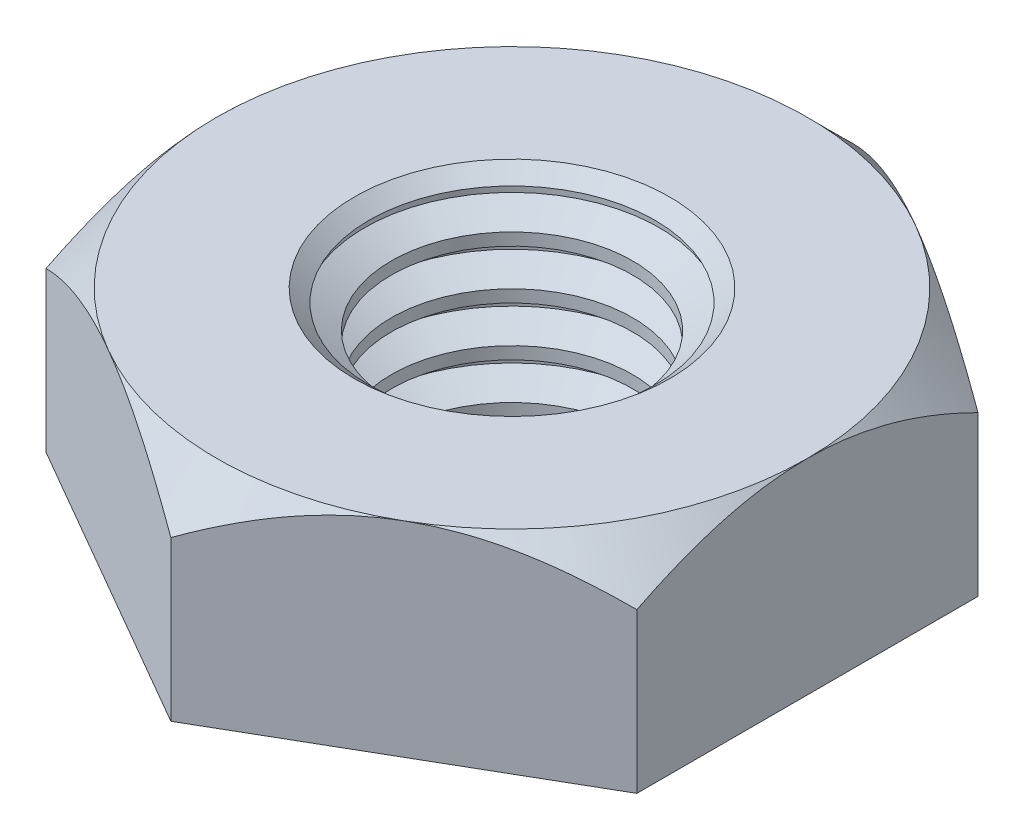
ISO-10303-21;
HEADER;
FILE_DESCRIPTION(('STEP AP214'),'2;1');
FILE_NAME('part.step','',(''),(''),'','','');
FILE_SCHEMA(('AUTOMOTIVE_DESIGN { 1 0 10303 214 1 1 1 1 }'));
ENDSEC;
DATA;
#1=APPLICATION_CONTEXT('core data for automotive mechanical design processes');
#2=APPLICATION_PROTOCOL_DEFINITION('international standard','automotive_design',2000,#1);
#3=PRODUCT_CONTEXT('',#1,'mechanical');
#4=PRODUCT('Part','Part','',(#3));
#5=PRODUCT_RELATED_PRODUCT_CATEGORY('part','',(#4));
#6=PRODUCT_DEFINITION_FORMATION('','',#4);
#7=PRODUCT_DEFINITION_CONTEXT('part definition',#1,'design');
#8=PRODUCT_DEFINITION('design','',#6,#7);
#9=PRODUCT_DEFINITION_SHAPE('','',#8);
#10=(LENGTH_UNIT() NAMED_UNIT(*) SI_UNIT(.MILLI.,.METRE.));
#11=(NAMED_UNIT(*) PLANE_ANGLE_UNIT() SI_UNIT($,.RADIAN.));
#12=(NAMED_UNIT(*) SI_UNIT($,.STERADIAN.) SOLID_ANGLE_UNIT());
#13=UNCERTAINTY_MEASURE_WITH_UNIT(LENGTH_MEASURE(1.E-05),#10,'distance_accuracy_value','');
#14=(GEOMETRIC_REPRESENTATION_CONTEXT(3) GLOBAL_UNCERTAINTY_ASSIGNED_CONTEXT((#13)) GLOBAL_UNIT_ASSIGNED_CONTEXT((#10,
#11,#12)) REPRESENTATION_CONTEXT('',''));
#15=CARTESIAN_POINT('',(0.,0.,0.));
#16=DIRECTION('',(0.,0.,1.));
#17=DIRECTION('',(1.,0.,0.));
#18=AXIS2_PLACEMENT_3D('',#15,#16,#17);
#19=CARTESIAN_POINT('',(0.,0.,-5.49926131403119));
#20=DIRECTION('',(0.,1.,0.));
#21=DIRECTION('',(0.,0.,1.));
#22=AXIS2_PLACEMENT_3D('',#19,#20,#21);
#23=PLANE('',#22);
#24=DIRECTION('',(-0.866025403784439,0.,-0.5));
#25=VECTOR('',#24,1.);
#26=CARTESIAN_POINT('',(4.7625,0.,-2.74963065701559));
#27=LINE('',#26,#25);
#28=CARTESIAN_POINT('',(4.7625,0.,-2.74963065701559));
#29=VERTEX_POINT('',#28);
#30=CARTESIAN_POINT('',(0.,0.,-5.49926131403119));
#31=VERTEX_POINT('',#30);
#32=EDGE_CURVE('E265',#29,#31,#27,.T.);
#33=ORIENTED_EDGE('',*,*,#32,.F.);
#34=DIRECTION('',(0.,0.,-1.));
#35=VECTOR('',#34,1.);
#36=CARTESIAN_POINT('',(4.7625,0.,2.7496306570156));
#37=LINE('',#36,#35);
#38=CARTESIAN_POINT('',(4.7625,0.,2.7496306570156));
#39=VERTEX_POINT('',#38);
#40=EDGE_CURVE('E272',#39,#29,#37,.T.);
#41=ORIENTED_EDGE('',*,*,#40,.F.);
#42=DIRECTION('',(0.866025403784439,0.,-0.5));
#43=VECTOR('',#42,1.);
#44=CARTESIAN_POINT('',(0.,0.,5.49926131403119));
#45=LINE('',#44,#43);
#46=CARTESIAN_POINT('',(0.,0.,5.49926131403119));
#47=VERTEX_POINT('',#46);
#48=EDGE_CURVE('E268',#47,#39,#45,.T.);
#49=ORIENTED_EDGE('',*,*,#48,.F.);
#50=DIRECTION('',(0.866025403784439,0.,0.5));
#51=VECTOR('',#50,1.);
#52=CARTESIAN_POINT('',(-4.7625,0.,2.7496306570156));
#53=LINE('',#52,#51);
#54=CARTESIAN_POINT('',(-4.7625,0.,2.7496306570156));
#55=VERTEX_POINT('',#54);
#56=EDGE_CURVE('E126',#55,#47,#53,.T.);
#57=ORIENTED_EDGE('',*,*,#56,.F.);
#58=DIRECTION('',(0.,0.,1.));
#59=VECTOR('',#58,1.);
#60=CARTESIAN_POINT('',(-4.7625,0.,-2.74963065701559));
#61=LINE('',#60,#59);
#62=CARTESIAN_POINT('',(-4.7625,0.,-2.74963065701559));
#63=VERTEX_POINT('',#62);
#64=EDGE_CURVE('E264',#63,#55,#61,.T.);
#65=ORIENTED_EDGE('',*,*,#64,.F.);
#66=DIRECTION('',(-0.866025403784439,0.,0.5));
#67=VECTOR('',#66,1.);
#68=CARTESIAN_POINT('',(0.,0.,-5.49926131403119));
#69=LINE('',#68,#67);
#70=EDGE_CURVE('E260',#31,#63,#69,.T.);
#71=ORIENTED_EDGE('',*,*,#70,.F.);
#72=EDGE_LOOP('',(#33,#41,#49,#57,#65,#71));
#73=FACE_BOUND('',#72,.T.);
#74=CARTESIAN_POINT('',(0.,0.,0.));
#75=DIRECTION('',(0.,1.,0.));
#76=DIRECTION('',(0.,0.,1.));
#77=AXIS2_PLACEMENT_3D('',#74,#75,#76);
#78=CIRCLE('',#77,2.16524066240256);
#79=CARTESIAN_POINT('',(0.,0.,2.16524066240256));
#80=VERTEX_POINT('',#79);
#81=EDGE_CURVE('E143',#80,#80,#78,.F.);
#82=ORIENTED_EDGE('',*,*,#81,.F.);
#83=EDGE_LOOP('',(#82));
#84=FACE_BOUND('',#83,.T.);
#85=ADVANCED_FACE('F33',(#73,#84),#23,.F.);
#86=CARTESIAN_POINT('',(0.,3.302,-5.49926131403119));
#87=DIRECTION('',(0.,1.,0.));
#88=DIRECTION('',(0.,0.,1.));
#89=AXIS2_PLACEMENT_3D('',#86,#87,#88);
#90=PLANE('',#89);
#91=CARTESIAN_POINT('',(0.,3.302,0.));
#92=DIRECTION('',(0.,1.,0.));
#93=DIRECTION('',(0.,0.,1.));
#94=AXIS2_PLACEMENT_3D('',#91,#92,#93);
#95=CIRCLE('',#94,2.54058270984131);
#96=CARTESIAN_POINT('',(0.,3.302,2.54058270984131));
#97=VERTEX_POINT('',#96);
#98=EDGE_CURVE('E12',#97,#97,#95,.F.);
#99=ORIENTED_EDGE('',*,*,#98,.T.);
#100=EDGE_LOOP('',(#99));
#101=FACE_BOUND('',#100,.T.);
#102=CARTESIAN_POINT('',(0.,3.302,0.));
#103=DIRECTION('',(0.,1.,0.));
#104=DIRECTION('',(0.,0.,1.));
#105=AXIS2_PLACEMENT_3D('',#102,#103,#104);
#106=CIRCLE('',#105,4.7625);
#107=CARTESIAN_POINT('',(-2.38125,3.302,4.12444598552339));
#108=VERTEX_POINT('',#107);
#109=CARTESIAN_POINT('',(2.38125,3.302,4.12444598552339));
#110=VERTEX_POINT('',#109);
#111=EDGE_CURVE('E108',#108,#110,#106,.T.);
#112=ORIENTED_EDGE('',*,*,#111,.T.);
#113=CARTESIAN_POINT('',(0.,3.302,0.));
#114=DIRECTION('',(0.,1.,0.));
#115=DIRECTION('',(0.,0.,1.));
#116=AXIS2_PLACEMENT_3D('',#113,#114,#115);
#117=CIRCLE('',#116,4.7625);
#118=CARTESIAN_POINT('',(4.7625,3.302,0.));
#119=VERTEX_POINT('',#118);
#120=EDGE_CURVE('E48',#110,#119,#117,.T.);
#121=ORIENTED_EDGE('',*,*,#120,.T.);
#122=CARTESIAN_POINT('',(2.38125,3.302,-4.12444598552339));
#123=VERTEX_POINT('',#122);
#124=EDGE_CURVE('E142',#119,#123,#106,.T.);
#125=ORIENTED_EDGE('',*,*,#124,.T.);
#126=CARTESIAN_POINT('',(-2.38125,3.302,-4.12444598552339));
#127=VERTEX_POINT('',#126);
#128=EDGE_CURVE('E150',#123,#127,#106,.T.);
#129=ORIENTED_EDGE('',*,*,#128,.T.);
#130=CARTESIAN_POINT('',(-4.7625,3.302,0.));
#131=VERTEX_POINT('',#130);
#132=EDGE_CURVE('E153',#127,#131,#106,.T.);
#133=ORIENTED_EDGE('',*,*,#132,.T.);
#134=EDGE_CURVE('E141',#131,#108,#106,.T.);
#135=ORIENTED_EDGE('',*,*,#134,.T.);
#136=EDGE_LOOP('',(#112,#121,#125,#129,#133,#135));
#137=FACE_BOUND('',#136,.T.);
#138=ADVANCED_FACE('F160',(#101,#137),#90,.T.);
#139=CARTESIAN_POINT('',(4.7625,3.302,-2.74963065701559));
#140=DIRECTION('',(-0.5,0.,0.866025403784439));
#141=DIRECTION('',(0.866025403784439,0.,0.5));
#142=AXIS2_PLACEMENT_3D('',#139,#140,#141);
#143=PLANE('',#142);
#144=CARTESIAN_POINT('',(4.7627,2.56512321227821,-2.74951518696175));
#145=CARTESIAN_POINT('',(4.68081065191613,2.61239793031628,-2.79679402412174));
#146=CARTESIAN_POINT('',(4.59829185668081,2.65822188447172,-2.84443627276406));
#147=CARTESIAN_POINT('',(4.43187187749233,2.74652693837568,-2.94051889254705));
#148=CARTESIAN_POINT('',(4.34796996833749,2.78900621234221,-2.98895968238313));
#149=CARTESIAN_POINT('',(4.09322481898627,2.91112729033667,-3.1360368629358));
#150=CARTESIAN_POINT('',(3.92022499960599,2.98493135098448,-3.23591835522476));
#151=CARTESIAN_POINT('',(3.57135699987269,3.11131583882171,-3.43733738878244));
#152=CARTESIAN_POINT('',(3.39557799324612,3.16421468136506,-3.53882344557617));
#153=CARTESIAN_POINT('',(3.12901952615455,3.22540573323106,-3.69272104830626));
#154=CARTESIAN_POINT('',(3.03977424818898,3.24276836479572,-3.74424683356358));
#155=CARTESIAN_POINT('',(2.8605280169181,3.27104831275387,-3.84773469343905));
#156=CARTESIAN_POINT('',(2.77052717859508,3.28196659245055,-3.89969670167214));
#157=CARTESIAN_POINT('',(2.55120982662339,3.30027251059082,-4.02631963387095));
#158=CARTESIAN_POINT('',(2.42165701180105,3.30411359873425,-4.1011169863829));
#159=CARTESIAN_POINT('',(2.16278485677864,3.29766760891884,-4.25057689477079));
#160=CARTESIAN_POINT('',(2.03346561433138,3.28737557837611,-4.32523939420912));
#161=CARTESIAN_POINT('',(1.77604630297694,3.25327002724339,-4.47386050291421));
#162=CARTESIAN_POINT('',(1.64794776075095,3.22944138454218,-4.54781823075118));
#163=CARTESIAN_POINT('',(1.39395236805384,3.1695580900519,-4.69446253909778));
#164=CARTESIAN_POINT('',(1.26805534954508,3.13350437569783,-4.76714921662399));
#165=CARTESIAN_POINT('',(1.04456117082446,3.05932926263512,-4.89618364087065));
#166=CARTESIAN_POINT('',(0.94646921271077,3.02315832531437,-4.95281705929293));
#167=CARTESIAN_POINT('',(0.752046240653395,2.94498737650639,-5.0650672145469));
#168=CARTESIAN_POINT('',(0.655715280303393,2.90298718794659,-5.12068392043627));
#169=CARTESIAN_POINT('',(0.465117705112443,2.81409929057463,-5.23072548177966));
#170=CARTESIAN_POINT('',(0.370845669478452,2.76722695143577,-5.28515346692999));
#171=CARTESIAN_POINT('',(0.184047336327337,2.66921019212027,-5.39300153485896));
#172=CARTESIAN_POINT('',(0.0915200100672314,2.61806839249079,-5.44642221158263));
#173=CARTESIAN_POINT('',(-0.000199999999999792,2.56512321227821,-5.49937678408502));
#174=B_SPLINE_CURVE_WITH_KNOTS('',3,(#144,#145,#146,#147,#148,#149,#150,#151,#152,#153,#154,
#155,#156,#157,#158,#159,#160,#161,#162,#163,#164,#165,#166,#167,#168,#169,#170,#171,#172,#173),
.UNSPECIFIED.,.F.,.F.,(4,2,2,2,2,2,2,2,2,2,2,2,2,2,4),(0.,0.317131998246116,0.634435928164957,
1.2724696784082,1.90037160310752,2.21370673072326,2.52699500906334,2.97522950661225,
3.42362111637259,3.87251462420208,4.32137371805217,4.67791268795822,5.03446249066167,
5.38991982411499,5.74516056370359),.UNSPECIFIED.);
#175=CARTESIAN_POINT('',(4.7625,2.56523868596882,-2.74963065701559));
#176=VERTEX_POINT('',#175);
#177=EDGE_CURVE('E275',#176,#123,#174,.T.);
#178=ORIENTED_EDGE('',*,*,#177,.F.);
#179=DIRECTION('',(0.,-1.,0.));
#180=VECTOR('',#179,1.);
#181=CARTESIAN_POINT('',(4.7625,3.302,-2.74963065701559));
#182=LINE('',#181,#180);
#183=EDGE_CURVE('E133',#176,#29,#182,.T.);
#184=ORIENTED_EDGE('',*,*,#183,.T.);
#185=ORIENTED_EDGE('',*,*,#32,.T.);
#186=DIRECTION('',(0.,-1.,0.));
#187=VECTOR('',#186,1.);
#188=CARTESIAN_POINT('',(0.,3.302,-5.49926131403119));
#189=LINE('',#188,#187);
#190=CARTESIAN_POINT('',(0.,2.56523868596882,-5.49926131403119));
#191=VERTEX_POINT('',#190);
#192=EDGE_CURVE('E138',#191,#31,#189,.T.);
#193=ORIENTED_EDGE('',*,*,#192,.F.);
#194=EDGE_CURVE('E212',#123,#191,#174,.T.);
#195=ORIENTED_EDGE('',*,*,#194,.F.);
#196=EDGE_LOOP('',(#178,#184,#185,#193,#195));
#197=FACE_BOUND('',#196,.T.);
#198=ADVANCED_FACE('F221',(#197),#143,.F.);
#199=CARTESIAN_POINT('',(0.,3.302,-5.49926131403119));
#200=DIRECTION('',(0.5,0.,0.866025403784439));
#201=DIRECTION('',(0.866025403784439,0.,-0.5));
#202=AXIS2_PLACEMENT_3D('',#199,#200,#201);
#203=PLANE('',#202);
#204=CARTESIAN_POINT('',(0.00020000000000009,2.56512321227821,-5.49937678408502));
#205=CARTESIAN_POINT('',(-0.0816893480838682,2.61239793031628,-5.45209794692504));
#206=CARTESIAN_POINT('',(-0.164208143319194,2.65822188447172,-5.40445569828272));
#207=CARTESIAN_POINT('',(-0.330628122507664,2.74652693837568,-5.30837307849972));
#208=CARTESIAN_POINT('',(-0.41453003166251,2.78900621234221,-5.25993228866365));
#209=CARTESIAN_POINT('',(-0.669275181013725,2.91112729033667,-5.11285510811098));
#210=CARTESIAN_POINT('',(-0.842275000394006,2.98493135098448,-5.01297361582201));
#211=CARTESIAN_POINT('',(-1.19114300012731,3.11131583882171,-4.81155458226434));
#212=CARTESIAN_POINT('',(-1.36692200675388,3.16421468136506,-4.71006852547061));
#213=CARTESIAN_POINT('',(-1.63348047384545,3.22540573323106,-4.55617092274052));
#214=CARTESIAN_POINT('',(-1.72272575181102,3.24276836479572,-4.50464513748319));
#215=CARTESIAN_POINT('',(-1.9019719830819,3.27104831275387,-4.40115727760773));
#216=CARTESIAN_POINT('',(-1.99197282140492,3.28196659245055,-4.34919526937464));
#217=CARTESIAN_POINT('',(-2.21129017337661,3.30027251059082,-4.22257233717583));
#218=CARTESIAN_POINT('',(-2.34084298819895,3.30411359873425,-4.14777498466388));
#219=CARTESIAN_POINT('',(-2.59971514322136,3.29766760891884,-3.99831507627599));
#220=CARTESIAN_POINT('',(-2.72903438566862,3.28737557837611,-3.92365257683766));
#221=CARTESIAN_POINT('',(-2.98645369702306,3.25327002724339,-3.77503146813257));
#222=CARTESIAN_POINT('',(-3.11455223924905,3.22944138454218,-3.7010737402956));
#223=CARTESIAN_POINT('',(-3.36854763194615,3.1695580900519,-3.554429431949));
#224=CARTESIAN_POINT('',(-3.49444465045492,3.13350437569783,-3.48174275442279));
#225=CARTESIAN_POINT('',(-3.71793882917554,3.05932926263512,-3.35270833017613));
#226=CARTESIAN_POINT('',(-3.81603078728923,3.02315832531437,-3.29607491175385));
#227=CARTESIAN_POINT('',(-4.0104537593466,2.94498737650639,-3.18382475649988));
#228=CARTESIAN_POINT('',(-4.10678471969661,2.90298718794659,-3.12820805061051));
#229=CARTESIAN_POINT('',(-4.29738229488756,2.81409929057463,-3.01816648926712));
#230=CARTESIAN_POINT('',(-4.39165433052155,2.76722695143577,-2.96373850411678));
#231=CARTESIAN_POINT('',(-4.57845266367266,2.66921019212027,-2.85589043618782));
#232=CARTESIAN_POINT('',(-4.67097998993277,2.61806839249079,-2.80246975946415));
#233=CARTESIAN_POINT('',(-4.7627,2.56512321227821,-2.74951518696176));
#234=B_SPLINE_CURVE_WITH_KNOTS('',3,(#204,#205,#206,#207,#208,#209,#210,#211,#212,#213,#214,
#215,#216,#217,#218,#219,#220,#221,#222,#223,#224,#225,#226,#227,#228,#229,#230,#231,#232,#233),
.UNSPECIFIED.,.F.,.F.,(4,2,2,2,2,2,2,2,2,2,2,2,2,2,4),(0.,0.317131998246117,0.634435928164957,
1.2724696784082,1.90037160310752,2.21370673072326,2.52699500906334,2.97522950661224,
3.42362111637259,3.87251462420208,4.32137371805217,4.67791268795822,5.03446249066167,
5.38991982411499,5.74516056370359),.UNSPECIFIED.);
#235=EDGE_CURVE('E211',#191,#127,#234,.T.);
#236=ORIENTED_EDGE('',*,*,#235,.F.);
#237=ORIENTED_EDGE('',*,*,#192,.T.);
#238=ORIENTED_EDGE('',*,*,#70,.T.);
#239=DIRECTION('',(0.,-1.,0.));
#240=VECTOR('',#239,1.);
#241=CARTESIAN_POINT('',(-4.7625,3.302,-2.74963065701559));
#242=LINE('',#241,#240);
#243=CARTESIAN_POINT('',(-4.7625,2.56523868596882,-2.74963065701559));
#244=VERTEX_POINT('',#243);
#245=EDGE_CURVE('E131',#244,#63,#242,.T.);
#246=ORIENTED_EDGE('',*,*,#245,.F.);
#247=EDGE_CURVE('E206',#127,#244,#234,.T.);
#248=ORIENTED_EDGE('',*,*,#247,.F.);
#249=EDGE_LOOP('',(#236,#237,#238,#246,#248));
#250=FACE_BOUND('',#249,.T.);
#251=ADVANCED_FACE('F217',(#250),#203,.F.);
#252=CARTESIAN_POINT('',(-4.7625,3.302,-2.74963065701559));
#253=DIRECTION('',(1.,0.,0.));
#254=DIRECTION('',(0.,0.,-1.));
#255=AXIS2_PLACEMENT_3D('',#252,#253,#254);
#256=PLANE('',#255);
#257=CARTESIAN_POINT('',(-4.7625,0.607359177812384,-5.73825260788835));
#258=CARTESIAN_POINT('',(-4.7625,0.714013378005021,-5.59961911198014));
#259=CARTESIAN_POINT('',(-4.7625,0.819711877142713,-5.46023863297166));
#260=CARTESIAN_POINT('',(-4.7625,1.02876084827567,-5.1796783922341));
#261=CARTESIAN_POINT('',(-4.7625,1.13211075884089,-5.03849821261898));
#262=CARTESIAN_POINT('',(-4.7625,1.3367614117004,-4.75300155018045));
#263=CARTESIAN_POINT('',(-4.7625,1.43804019384906,-4.60866927417928));
#264=CARTESIAN_POINT('',(-4.7625,1.63707322946288,-4.31760261048955));
#265=CARTESIAN_POINT('',(-4.7625,1.73482772561311,-4.17086838921646));
#266=CARTESIAN_POINT('',(-4.7625,1.93207075363514,-3.86520042100702));
#267=CARTESIAN_POINT('',(-4.7625,2.03127620420197,-3.70608308470106));
#268=CARTESIAN_POINT('',(-4.7625,2.22352957821294,-3.38411178709566));
#269=CARTESIAN_POINT('',(-4.7625,2.31657646540155,-3.22125720313444));
#270=CARTESIAN_POINT('',(-4.7625,2.49453114969727,-2.89176685981637));
#271=CARTESIAN_POINT('',(-4.7625,2.5794628391487,-2.72514410620004));
#272=CARTESIAN_POINT('',(-4.7625,2.73928425167475,-2.3871883334313));
#273=CARTESIAN_POINT('',(-4.7625,2.81417871199232,-2.2158575826377));
#274=CARTESIAN_POINT('',(-4.7625,2.94444904594442,-1.88527007852251));
#275=CARTESIAN_POINT('',(-4.7625,3.00102159975637,-1.72648972877848));
#276=CARTESIAN_POINT('',(-4.7625,3.10145731584694,-1.40488378373978));
#277=CARTESIAN_POINT('',(-4.7625,3.14531966861009,-1.24205793150294));
#278=CARTESIAN_POINT('',(-4.7625,3.21722963716689,-0.916169295673709));
#279=CARTESIAN_POINT('',(-4.7625,3.24556448873623,-0.753170976146872));
#280=CARTESIAN_POINT('',(-4.7625,3.2858283372307,-0.425149219299888));
#281=CARTESIAN_POINT('',(-4.7625,3.29776073790502,-0.260126209306074));
#282=CARTESIAN_POINT('',(-4.7625,3.30420325978869,0.0630444296005207));
#283=CARTESIAN_POINT('',(-4.7625,3.29945171516462,0.221177476865726));
#284=CARTESIAN_POINT('',(-4.7625,3.27448365171923,0.536209574693509));
#285=CARTESIAN_POINT('',(-4.7625,3.25426572819256,0.693108511862579));
#286=CARTESIAN_POINT('',(-4.7625,3.19916443923842,1.00719592523009));
#287=CARTESIAN_POINT('',(-4.7625,3.1640221530458,1.16433820178455));
#288=CARTESIAN_POINT('',(-4.7625,3.08102178744668,1.47516220522088));
#289=CARTESIAN_POINT('',(-4.7625,3.03316443024096,1.62884412810908));
#290=CARTESIAN_POINT('',(-4.7625,2.92377235777958,1.94121388831563));
#291=CARTESIAN_POINT('',(-4.7625,2.86160754977849,2.09967854005784));
#292=CARTESIAN_POINT('',(-4.7625,2.72767388241329,2.41253183864121));
#293=CARTESIAN_POINT('',(-4.7625,2.65590069256642,2.56691860980216));
#294=CARTESIAN_POINT('',(-4.7625,2.50445234731151,2.87234524812367));
#295=CARTESIAN_POINT('',(-4.7625,2.42475285372551,3.02337294826259));
#296=CARTESIAN_POINT('',(-4.7625,2.25920577749163,3.3219676206046));
#297=CARTESIAN_POINT('',(-4.7625,2.17335914146477,3.46953512103036));
#298=CARTESIAN_POINT('',(-4.7625,2.00107920212899,3.75444944079091));
#299=CARTESIAN_POINT('',(-4.7625,1.9148842084088,3.89194112489109));
#300=CARTESIAN_POINT('',(-4.7625,1.73882532790887,4.16456228260228));
#301=CARTESIAN_POINT('',(-4.7625,1.64896116605642,4.29969157801954));
#302=CARTESIAN_POINT('',(-4.7625,1.46694982531301,4.56681060039742));
#303=CARTESIAN_POINT('',(-4.7625,1.37482676941846,4.69881682375371));
#304=CARTESIAN_POINT('',(-4.7625,1.18811116280264,4.96101832443806));
#305=CARTESIAN_POINT('',(-4.7625,1.09351929983533,5.09121409094934));
#306=CARTESIAN_POINT('',(-4.7625,0.997916890285899,5.22065039975835));
#307=B_SPLINE_CURVE_WITH_KNOTS('',3,(#257,#258,#259,#260,#261,#262,#263,#264,#265,#266,#267,
#268,#269,#270,#271,#272,#273,#274,#275,#276,#277,#278,#279,#280,#281,#282,#283,#284,#285,#286,
#287,#288,#289,#290,#291,#292,#293,#294,#295,#296,#297,#298,#299,#300,#301,#302,#303,#304,#305,
#306),.UNSPECIFIED.,.F.,.F.,(4,2,2,2,2,2,2,2,2,2,2,2,2,2,2,2,2,2,2,2,2,2,2,2,4),(0.,
0.524746972153175,1.04961809284433,1.57853849327643,2.10742240200035,2.66984197063992,
3.23235593410321,3.79315915598468,4.35369675795085,4.85893363753941,5.36420268870568,
5.85977907522794,6.3552526068471,6.82908097087864,7.30295237460786,7.78540424697844,
8.26782872251685,8.77810330329841,9.28860864320615,9.80073298351529,10.3127786288216,
10.7995387337387,11.2863353976663,11.7692236268743,12.2519787406759),.UNSPECIFIED.);
#308=EDGE_CURVE('E165',#244,#131,#307,.T.);
#309=ORIENTED_EDGE('',*,*,#308,.F.);
#310=ORIENTED_EDGE('',*,*,#245,.T.);
#311=ORIENTED_EDGE('',*,*,#64,.T.);
#312=DIRECTION('',(0.,-1.,0.));
#313=VECTOR('',#312,1.);
#314=CARTESIAN_POINT('',(-4.7625,3.302,2.7496306570156));
#315=LINE('',#314,#313);
#316=CARTESIAN_POINT('',(-4.7625,2.56523868596882,2.7496306570156));
#317=VERTEX_POINT('',#316);
#318=EDGE_CURVE('E128',#317,#55,#315,.T.);
#319=ORIENTED_EDGE('',*,*,#318,.F.);
#320=EDGE_CURVE('E163',#131,#317,#307,.T.);
#321=ORIENTED_EDGE('',*,*,#320,.F.);
#322=EDGE_LOOP('',(#309,#310,#311,#319,#321));
#323=FACE_BOUND('',#322,.T.);
#324=ADVANCED_FACE('F220',(#323),#256,.F.);
#325=CARTESIAN_POINT('',(-4.7625,3.302,2.7496306570156));
#326=DIRECTION('',(0.5,0.,-0.866025403784439));
#327=DIRECTION('',(-0.866025403784439,0.,-0.5));
#328=AXIS2_PLACEMENT_3D('',#325,#326,#327);
#329=PLANE('',#328);
#330=CARTESIAN_POINT('',(-4.7627,2.56512321227821,2.74951518696176));
#331=CARTESIAN_POINT('',(-4.68081065191613,2.61239793031628,2.79679402412174));
#332=CARTESIAN_POINT('',(-4.59829185668081,2.65822188447172,2.84443627276406));
#333=CARTESIAN_POINT('',(-4.43187187749233,2.74652693837568,2.94051889254706));
#334=CARTESIAN_POINT('',(-4.34796996833749,2.78900621234221,2.98895968238313));
#335=CARTESIAN_POINT('',(-4.09322481898627,2.91112729033667,3.13603686293581));
#336=CARTESIAN_POINT('',(-3.92022499960599,2.98493135098448,3.23591835522477));
#337=CARTESIAN_POINT('',(-3.57135699987269,3.11131583882171,3.43733738878244));
#338=CARTESIAN_POINT('',(-3.39557799324612,3.16421468136506,3.53882344557617));
#339=CARTESIAN_POINT('',(-3.12901952615455,3.22540573323106,3.69272104830627));
#340=CARTESIAN_POINT('',(-3.03977424818898,3.24276836479572,3.74424683356359));
#341=CARTESIAN_POINT('',(-2.8605280169181,3.27104831275387,3.84773469343906));
#342=CARTESIAN_POINT('',(-2.77052717859507,3.28196659245055,3.89969670167215));
#343=CARTESIAN_POINT('',(-2.55120982662339,3.30027251059081,4.02631963387096));
#344=CARTESIAN_POINT('',(-2.42165701180105,3.30411359873425,4.10111698638291));
#345=CARTESIAN_POINT('',(-2.16278485677864,3.29766760891884,4.2505768947708));
#346=CARTESIAN_POINT('',(-2.03346561433137,3.28737557837611,4.32523939420912));
#347=CARTESIAN_POINT('',(-1.77604630297694,3.25327002724339,4.47386050291421));
#348=CARTESIAN_POINT('',(-1.64794776075095,3.22944138454218,4.54781823075119));
#349=CARTESIAN_POINT('',(-1.39395236805384,3.16955809005189,4.69446253909779));
#350=CARTESIAN_POINT('',(-1.26805534954508,3.13350437569782,4.76714921662399));
#351=CARTESIAN_POINT('',(-1.04456117082446,3.05932926263512,4.89618364087066));
#352=CARTESIAN_POINT('',(-0.946469212710768,3.02315832531436,4.95281705929293));
#353=CARTESIAN_POINT('',(-0.752046240653393,2.94498737650638,5.06506721454691));
#354=CARTESIAN_POINT('',(-0.655715280303391,2.90298718794659,5.12068392043628));
#355=CARTESIAN_POINT('',(-0.465117705112441,2.81409929057462,5.23072548177966));
#356=CARTESIAN_POINT('',(-0.370845669478451,2.76722695143576,5.28515346693));
#357=CARTESIAN_POINT('',(-0.184047336327336,2.66921019212026,5.39300153485897));
#358=CARTESIAN_POINT('',(-0.0915200100672307,2.61806839249079,5.44642221158264));
#359=CARTESIAN_POINT('',(0.000200000000000378,2.56512321227821,5.49937678408503));
#360=B_SPLINE_CURVE_WITH_KNOTS('',3,(#330,#331,#332,#333,#334,#335,#336,#337,#338,#339,#340,
#341,#342,#343,#344,#345,#346,#347,#348,#349,#350,#351,#352,#353,#354,#355,#356,#357,#358,#359),
.UNSPECIFIED.,.F.,.F.,(4,2,2,2,2,2,2,2,2,2,2,2,2,2,4),(0.,0.317131998246117,0.634435928164958,
1.2724696784082,1.90037160310752,2.21370673072326,2.52699500906335,2.97522950661225,
3.4236211163726,3.87251462420208,4.32137371805217,4.67791268795822,5.03446249066167,
5.389919824115,5.74516056370359),.UNSPECIFIED.);
#361=EDGE_CURVE('E113',#317,#108,#360,.T.);
#362=ORIENTED_EDGE('',*,*,#361,.F.);
#363=ORIENTED_EDGE('',*,*,#318,.T.);
#364=ORIENTED_EDGE('',*,*,#56,.T.);
#365=DIRECTION('',(0.,-1.,0.));
#366=VECTOR('',#365,1.);
#367=CARTESIAN_POINT('',(0.,3.302,5.49926131403119));
#368=LINE('',#367,#366);
#369=CARTESIAN_POINT('',(0.,2.56523868596882,5.49926131403119));
#370=VERTEX_POINT('',#369);
#371=EDGE_CURVE('E119',#370,#47,#368,.T.);
#372=ORIENTED_EDGE('',*,*,#371,.F.);
#373=EDGE_CURVE('E104',#108,#370,#360,.T.);
#374=ORIENTED_EDGE('',*,*,#373,.F.);
#375=EDGE_LOOP('',(#362,#363,#364,#372,#374));
#376=FACE_BOUND('',#375,.T.);
#377=ADVANCED_FACE('F124',(#376),#329,.F.);
#378=CARTESIAN_POINT('',(0.,3.302,5.49926131403119));
#379=DIRECTION('',(-0.5,0.,-0.866025403784439));
#380=DIRECTION('',(-0.866025403784439,0.,0.5));
#381=AXIS2_PLACEMENT_3D('',#378,#379,#380);
#382=PLANE('',#381);
#383=CARTESIAN_POINT('',(-0.000200000000000443,2.56512321227821,5.49937678408503));
#384=CARTESIAN_POINT('',(0.081689348083868,2.61239793031628,5.45209794692504));
#385=CARTESIAN_POINT('',(0.164208143319194,2.65822188447172,5.40445569828272));
#386=CARTESIAN_POINT('',(0.330628122507664,2.74652693837568,5.30837307849973));
#387=CARTESIAN_POINT('',(0.414530031662509,2.78900621234221,5.25993228866366));
#388=CARTESIAN_POINT('',(0.669275181013725,2.91112729033667,5.11285510811098));
#389=CARTESIAN_POINT('',(0.842275000394006,2.98493135098448,5.01297361582202));
#390=CARTESIAN_POINT('',(1.19114300012731,3.11131583882171,4.81155458226435));
#391=CARTESIAN_POINT('',(1.36692200675388,3.16421468136506,4.71006852547061));
#392=CARTESIAN_POINT('',(1.63348047384545,3.22540573323106,4.55617092274052));
#393=CARTESIAN_POINT('',(1.72272575181102,3.24276836479572,4.5046451374832));
#394=CARTESIAN_POINT('',(1.9019719830819,3.27104831275387,4.40115727760773));
#395=CARTESIAN_POINT('',(1.99197282140493,3.28196659245055,4.34919526937464));
#396=CARTESIAN_POINT('',(2.21129017337661,3.30027251059081,4.22257233717583));
#397=CARTESIAN_POINT('',(2.34084298819895,3.30411359873425,4.14777498466388));
#398=CARTESIAN_POINT('',(2.59971514322136,3.29766760891884,3.99831507627599));
#399=CARTESIAN_POINT('',(2.72903438566863,3.28737557837611,3.92365257683766));
#400=CARTESIAN_POINT('',(2.98645369702306,3.25327002724339,3.77503146813257));
#401=CARTESIAN_POINT('',(3.11455223924905,3.22944138454218,3.7010737402956));
#402=CARTESIAN_POINT('',(3.36854763194616,3.16955809005189,3.554429431949));
#403=CARTESIAN_POINT('',(3.49444465045492,3.13350437569782,3.48174275442279));
#404=CARTESIAN_POINT('',(3.71793882917554,3.05932926263512,3.35270833017613));
#405=CARTESIAN_POINT('',(3.81603078728923,3.02315832531436,3.29607491175385));
#406=CARTESIAN_POINT('',(4.01045375934661,2.94498737650638,3.18382475649988));
#407=CARTESIAN_POINT('',(4.10678471969661,2.90298718794659,3.12820805061051));
#408=CARTESIAN_POINT('',(4.29738229488756,2.81409929057462,3.01816648926713));
#409=CARTESIAN_POINT('',(4.39165433052155,2.76722695143576,2.96373850411679));
#410=CARTESIAN_POINT('',(4.57845266367266,2.66921019212026,2.85589043618782));
#411=CARTESIAN_POINT('',(4.67097998993277,2.61806839249079,2.80246975946415));
#412=CARTESIAN_POINT('',(4.7627,2.56512321227821,2.74951518696176));
#413=B_SPLINE_CURVE_WITH_KNOTS('',3,(#383,#384,#385,#386,#387,#388,#389,#390,#391,#392,#393,
#394,#395,#396,#397,#398,#399,#400,#401,#402,#403,#404,#405,#406,#407,#408,#409,#410,#411,#412),
.UNSPECIFIED.,.F.,.F.,(4,2,2,2,2,2,2,2,2,2,2,2,2,2,4),(0.,0.317131998246116,0.634435928164957,
1.2724696784082,1.90037160310752,2.21370673072326,2.52699500906334,2.97522950661225,
3.42362111637259,3.87251462420208,4.32137371805217,4.67791268795822,5.03446249066167,
5.38991982411499,5.74516056370359),.UNSPECIFIED.);
#414=EDGE_CURVE('E107',#370,#110,#413,.T.);
#415=ORIENTED_EDGE('',*,*,#414,.F.);
#416=ORIENTED_EDGE('',*,*,#371,.T.);
#417=ORIENTED_EDGE('',*,*,#48,.T.);
#418=DIRECTION('',(0.,-1.,0.));
#419=VECTOR('',#418,1.);
#420=CARTESIAN_POINT('',(4.7625,3.302,2.7496306570156));
#421=LINE('',#420,#419);
#422=CARTESIAN_POINT('',(4.7625,2.56523868596882,2.74963065701559));
#423=VERTEX_POINT('',#422);
#424=EDGE_CURVE('E129',#423,#39,#421,.T.);
#425=ORIENTED_EDGE('',*,*,#424,.F.);
#426=EDGE_CURVE('E122',#110,#423,#413,.T.);
#427=ORIENTED_EDGE('',*,*,#426,.F.);
#428=EDGE_LOOP('',(#415,#416,#417,#425,#427));
#429=FACE_BOUND('',#428,.T.);
#430=ADVANCED_FACE('F117',(#429),#382,.F.);
#431=CARTESIAN_POINT('',(4.7625,3.302,2.7496306570156));
#432=DIRECTION('',(-1.,0.,0.));
#433=DIRECTION('',(0.,0.,1.));
#434=AXIS2_PLACEMENT_3D('',#431,#432,#433);
#435=PLANE('',#434);
#436=CARTESIAN_POINT('',(4.7625,0.607359177812387,-5.73825260788835));
#437=CARTESIAN_POINT('',(4.7625,0.714013378005024,-5.59961911198014));
#438=CARTESIAN_POINT('',(4.7625,0.819711877142716,-5.46023863297166));
#439=CARTESIAN_POINT('',(4.7625,1.02876084827567,-5.1796783922341));
#440=CARTESIAN_POINT('',(4.7625,1.13211075884089,-5.03849821261898));
#441=CARTESIAN_POINT('',(4.7625,1.3367614117004,-4.75300155018045));
#442=CARTESIAN_POINT('',(4.7625,1.43804019384906,-4.60866927417928));
#443=CARTESIAN_POINT('',(4.7625,1.63707322946288,-4.31760261048955));
#444=CARTESIAN_POINT('',(4.7625,1.73482772561311,-4.17086838921646));
#445=CARTESIAN_POINT('',(4.7625,1.93207075363515,-3.86520042100702));
#446=CARTESIAN_POINT('',(4.7625,2.03127620420197,-3.70608308470106));
#447=CARTESIAN_POINT('',(4.7625,2.22352957821294,-3.38411178709566));
#448=CARTESIAN_POINT('',(4.7625,2.31657646540155,-3.22125720313444));
#449=CARTESIAN_POINT('',(4.7625,2.49453114969727,-2.89176685981637));
#450=CARTESIAN_POINT('',(4.7625,2.5794628391487,-2.72514410620004));
#451=CARTESIAN_POINT('',(4.7625,2.73928425167475,-2.3871883334313));
#452=CARTESIAN_POINT('',(4.7625,2.81417871199232,-2.2158575826377));
#453=CARTESIAN_POINT('',(4.7625,2.94444904594442,-1.88527007852251));
#454=CARTESIAN_POINT('',(4.7625,3.00102159975637,-1.72648972877848));
#455=CARTESIAN_POINT('',(4.7625,3.10145731584694,-1.40488378373978));
#456=CARTESIAN_POINT('',(4.7625,3.14531966861009,-1.24205793150294));
#457=CARTESIAN_POINT('',(4.7625,3.21722963716689,-0.916169295673708));
#458=CARTESIAN_POINT('',(4.7625,3.24556448873623,-0.753170976146871));
#459=CARTESIAN_POINT('',(4.7625,3.2858283372307,-0.425149219299888));
#460=CARTESIAN_POINT('',(4.7625,3.29776073790502,-0.260126209306074));
#461=CARTESIAN_POINT('',(4.7625,3.30420325978869,0.0630444296005207));
#462=CARTESIAN_POINT('',(4.7625,3.29945171516462,0.221177476865726));
#463=CARTESIAN_POINT('',(4.7625,3.27448365171923,0.536209574693509));
#464=CARTESIAN_POINT('',(4.7625,3.25426572819256,0.693108511862579));
#465=CARTESIAN_POINT('',(4.7625,3.19916443923842,1.00719592523009));
#466=CARTESIAN_POINT('',(4.7625,3.16402215304581,1.16433820178455));
#467=CARTESIAN_POINT('',(4.7625,3.08102178744668,1.47516220522088));
#468=CARTESIAN_POINT('',(4.7625,3.03316443024096,1.62884412810908));
#469=CARTESIAN_POINT('',(4.7625,2.92377235777958,1.94121388831563));
#470=CARTESIAN_POINT('',(4.7625,2.86160754977849,2.09967854005784));
#471=CARTESIAN_POINT('',(4.7625,2.72767388241329,2.41253183864121));
#472=CARTESIAN_POINT('',(4.7625,2.65590069256642,2.56691860980216));
#473=CARTESIAN_POINT('',(4.7625,2.50445234731151,2.87234524812367));
#474=CARTESIAN_POINT('',(4.7625,2.4247528537255,3.02337294826258));
#475=CARTESIAN_POINT('',(4.7625,2.25920577749163,3.3219676206046));
#476=CARTESIAN_POINT('',(4.7625,2.17335914146477,3.46953512103036));
#477=CARTESIAN_POINT('',(4.7625,2.00107920212899,3.75444944079091));
#478=CARTESIAN_POINT('',(4.7625,1.9148842084088,3.89194112489109));
#479=CARTESIAN_POINT('',(4.7625,1.73882532790887,4.16456228260228));
#480=CARTESIAN_POINT('',(4.7625,1.64896116605642,4.29969157801954));
#481=CARTESIAN_POINT('',(4.7625,1.46694982531301,4.56681060039742));
#482=CARTESIAN_POINT('',(4.7625,1.37482676941846,4.6988168237537));
#483=CARTESIAN_POINT('',(4.7625,1.18811116280264,4.96101832443806));
#484=CARTESIAN_POINT('',(4.7625,1.09351929983533,5.09121409094934));
#485=CARTESIAN_POINT('',(4.7625,0.997916890285898,5.22065039975835));
#486=B_SPLINE_CURVE_WITH_KNOTS('',3,(#436,#437,#438,#439,#440,#441,#442,#443,#444,#445,#446,
#447,#448,#449,#450,#451,#452,#453,#454,#455,#456,#457,#458,#459,#460,#461,#462,#463,#464,#465,
#466,#467,#468,#469,#470,#471,#472,#473,#474,#475,#476,#477,#478,#479,#480,#481,#482,#483,#484,
#485),.UNSPECIFIED.,.F.,.F.,(4,2,2,2,2,2,2,2,2,2,2,2,2,2,2,2,2,2,2,2,2,2,2,2,4),(0.,
0.524746972153175,1.04961809284433,1.57853849327643,2.10742240200035,2.66984197063991,
3.23235593410321,3.79315915598468,4.35369675795084,4.85893363753941,5.36420268870567,
5.85977907522794,6.3552526068471,6.82908097087864,7.30295237460786,7.78540424697844,
8.26782872251685,8.7781033032984,9.28860864320614,9.80073298351528,10.3127786288216,
10.7995387337387,11.2863353976663,11.7692236268743,12.2519787406758),.UNSPECIFIED.);
#487=EDGE_CURVE('E296',#423,#119,#486,.F.);
#488=ORIENTED_EDGE('',*,*,#487,.F.);
#489=ORIENTED_EDGE('',*,*,#424,.T.);
#490=ORIENTED_EDGE('',*,*,#40,.T.);
#491=ORIENTED_EDGE('',*,*,#183,.F.);
#492=EDGE_CURVE('E196',#119,#176,#486,.F.);
#493=ORIENTED_EDGE('',*,*,#492,.F.);
#494=EDGE_LOOP('',(#488,#489,#490,#491,#493));
#495=FACE_BOUND('',#494,.T.);
#496=ADVANCED_FACE('F238',(#495),#435,.F.);
#497=CARTESIAN_POINT('',(0.,3.302,0.));
#498=DIRECTION('',(0.,-1.,0.));
#499=DIRECTION('',(0.,0.,-1.));
#500=AXIS2_PLACEMENT_3D('',#497,#498,#499);
#501=CONICAL_SURFACE('',#500,4.7625,0.785398163397455);
#502=ORIENTED_EDGE('',*,*,#373,.T.);
#503=ORIENTED_EDGE('',*,*,#414,.T.);
#504=ORIENTED_EDGE('',*,*,#111,.F.);
#505=EDGE_LOOP('',(#502,#503,#504));
#506=FACE_BOUND('',#505,.T.);
#507=ADVANCED_FACE('F106',(#506),#501,.T.);
#508=ORIENTED_EDGE('',*,*,#320,.T.);
#509=ORIENTED_EDGE('',*,*,#361,.T.);
#510=ORIENTED_EDGE('',*,*,#134,.F.);
#511=EDGE_LOOP('',(#508,#509,#510));
#512=FACE_BOUND('',#511,.T.);
#513=ADVANCED_FACE('F162',(#512),#501,.T.);
#514=ORIENTED_EDGE('',*,*,#247,.T.);
#515=ORIENTED_EDGE('',*,*,#308,.T.);
#516=ORIENTED_EDGE('',*,*,#132,.F.);
#517=EDGE_LOOP('',(#514,#515,#516));
#518=FACE_BOUND('',#517,.T.);
#519=ADVANCED_FACE('F280',(#518),#501,.T.);
#520=ORIENTED_EDGE('',*,*,#194,.T.);
#521=ORIENTED_EDGE('',*,*,#235,.T.);
#522=ORIENTED_EDGE('',*,*,#128,.F.);
#523=EDGE_LOOP('',(#520,#521,#522));
#524=FACE_BOUND('',#523,.T.);
#525=ADVANCED_FACE('F189',(#524),#501,.T.);
#526=ORIENTED_EDGE('',*,*,#177,.T.);
#527=ORIENTED_EDGE('',*,*,#124,.F.);
#528=ORIENTED_EDGE('',*,*,#492,.T.);
#529=EDGE_LOOP('',(#526,#527,#528));
#530=FACE_BOUND('',#529,.T.);
#531=ADVANCED_FACE('F183',(#530),#501,.T.);
#532=ORIENTED_EDGE('',*,*,#426,.T.);
#533=ORIENTED_EDGE('',*,*,#487,.T.);
#534=ORIENTED_EDGE('',*,*,#120,.F.);
#535=EDGE_LOOP('',(#532,#533,#534));
#536=FACE_BOUND('',#535,.T.);
#537=ADVANCED_FACE('F188',(#536),#501,.T.);
#538=CARTESIAN_POINT('',(0.,3.053953125,0.));
#539=DIRECTION('',(0.,-1.,0.));
#540=DIRECTION('',(0.,0.,-1.));
#541=AXIS2_PLACEMENT_3D('',#538,#539,#540);
#542=CONICAL_SURFACE('',#541,2.3749,1.0471975511966);
#543=CARTESIAN_POINT('',(0.,3.09546775897641,0.));
#544=DIRECTION('',(0.,1.,0.));
#545=DIRECTION('',(0.,0.,1.));
#546=AXIS2_PLACEMENT_3D('',#543,#544,#545);
#547=CIRCLE('',#546,2.30299454469522);
#548=CARTESIAN_POINT('',(0.,3.09546775897641,2.30299454469522));
#549=VERTEX_POINT('',#548);
#550=EDGE_CURVE('E41',#549,#549,#547,.T.);
#551=ORIENTED_EDGE('',*,*,#550,.T.);
#552=EDGE_LOOP('',(#551));
#553=FACE_BOUND('',#552,.T.);
#554=CARTESIAN_POINT('',(0.,3.053953125,0.));
#555=DIRECTION('',(0.,1.,0.));
#556=DIRECTION('',(0.,0.,1.));
#557=AXIS2_PLACEMENT_3D('',#554,#555,#556);
#558=CIRCLE('',#557,2.3749);
#559=CARTESIAN_POINT('',(0.,3.053953125,2.3749));
#560=VERTEX_POINT('',#559);
#561=EDGE_CURVE('E297',#560,#560,#558,.T.);
#562=ORIENTED_EDGE('',*,*,#561,.F.);
#563=EDGE_LOOP('',(#562));
#564=FACE_BOUND('',#563,.T.);
#565=ADVANCED_FACE('F191',(#553,#564),#542,.F.);
#566=CARTESIAN_POINT('',(0.,1.66357854098429,0.));
#567=DIRECTION('',(0.,1.,0.));
#568=DIRECTION('',(0.,0.,1.));
#569=AXIS2_PLACEMENT_3D('',#566,#567,#568);
#570=CYLINDRICAL_SURFACE('',#569,2.3749);
#571=ORIENTED_EDGE('',*,*,#561,.T.);
#572=EDGE_LOOP('',(#571));
#573=FACE_BOUND('',#572,.T.);
#574=CARTESIAN_POINT('',(0.,2.954734375,0.));
#575=DIRECTION('',(0.,1.,0.));
#576=DIRECTION('',(0.,0.,1.));
#577=AXIS2_PLACEMENT_3D('',#574,#575,#576);
#578=CIRCLE('',#577,2.3749);
#579=CARTESIAN_POINT('',(0.,2.954734375,2.3749));
#580=VERTEX_POINT('',#579);
#581=EDGE_CURVE('E299',#580,#580,#578,.T.);
#582=ORIENTED_EDGE('',*,*,#581,.F.);
#583=EDGE_LOOP('',(#582));
#584=FACE_BOUND('',#583,.T.);
#585=ADVANCED_FACE('F295',(#573,#584),#570,.F.);
#586=CARTESIAN_POINT('',(0.,2.7066875,0.));
#587=DIRECTION('',(0.,1.,0.));
#588=DIRECTION('',(0.,0.,1.));
#589=AXIS2_PLACEMENT_3D('',#586,#587,#588);
#590=CONICAL_SURFACE('',#589,1.94527020984131,1.0471975511966);
#591=ORIENTED_EDGE('',*,*,#581,.T.);
#592=EDGE_LOOP('',(#591));
#593=FACE_BOUND('',#592,.T.);
#594=CARTESIAN_POINT('',(0.,2.7066875,0.));
#595=DIRECTION('',(0.,1.,0.));
#596=DIRECTION('',(0.,0.,1.));
#597=AXIS2_PLACEMENT_3D('',#594,#595,#596);
#598=CIRCLE('',#597,1.94527020984131);
#599=CARTESIAN_POINT('',(0.,2.7066875,1.94527020984131));
#600=VERTEX_POINT('',#599);
#601=EDGE_CURVE('E304',#600,#600,#598,.T.);
#602=ORIENTED_EDGE('',*,*,#601,.F.);
#603=EDGE_LOOP('',(#602));
#604=FACE_BOUND('',#603,.T.);
#605=ADVANCED_FACE('F404',(#593,#604),#590,.F.);
#606=CARTESIAN_POINT('',(0.,1.66357854098429,0.));
#607=DIRECTION('',(0.,1.,0.));
#608=DIRECTION('',(0.,0.,1.));
#609=AXIS2_PLACEMENT_3D('',#606,#607,#608);
#610=CYLINDRICAL_SURFACE('',#609,1.94527020984131);
#611=ORIENTED_EDGE('',*,*,#601,.T.);
#612=EDGE_LOOP('',(#611));
#613=FACE_BOUND('',#612,.T.);
#614=CARTESIAN_POINT('',(0.,2.50825,0.));
#615=DIRECTION('',(0.,1.,0.));
#616=DIRECTION('',(0.,0.,1.));
#617=AXIS2_PLACEMENT_3D('',#614,#615,#616);
#618=CIRCLE('',#617,1.94527020984131);
#619=CARTESIAN_POINT('',(0.,2.50825,1.94527020984131));
#620=VERTEX_POINT('',#619);
#621=EDGE_CURVE('E307',#620,#620,#618,.T.);
#622=ORIENTED_EDGE('',*,*,#621,.F.);
#623=EDGE_LOOP('',(#622));
#624=FACE_BOUND('',#623,.T.);
#625=ADVANCED_FACE('F400',(#613,#624),#610,.F.);
#626=CARTESIAN_POINT('',(0.,2.260203125,0.));
#627=DIRECTION('',(0.,-1.,0.));
#628=DIRECTION('',(0.,0.,-1.));
#629=AXIS2_PLACEMENT_3D('',#626,#627,#628);
#630=CONICAL_SURFACE('',#629,2.3749,1.0471975511966);
#631=ORIENTED_EDGE('',*,*,#621,.T.);
#632=EDGE_LOOP('',(#631));
#633=FACE_BOUND('',#632,.T.);
#634=CARTESIAN_POINT('',(0.,2.260203125,0.));
#635=DIRECTION('',(0.,1.,0.));
#636=DIRECTION('',(0.,0.,1.));
#637=AXIS2_PLACEMENT_3D('',#634,#635,#636);
#638=CIRCLE('',#637,2.3749);
#639=CARTESIAN_POINT('',(0.,2.260203125,2.3749));
#640=VERTEX_POINT('',#639);
#641=EDGE_CURVE('E310',#640,#640,#638,.T.);
#642=ORIENTED_EDGE('',*,*,#641,.F.);
#643=EDGE_LOOP('',(#642));
#644=FACE_BOUND('',#643,.T.);
#645=ADVANCED_FACE('F396',(#633,#644),#630,.F.);
#646=CARTESIAN_POINT('',(0.,0.869828540984293,0.));
#647=DIRECTION('',(0.,1.,0.));
#648=DIRECTION('',(0.,0.,1.));
#649=AXIS2_PLACEMENT_3D('',#646,#647,#648);
#650=CYLINDRICAL_SURFACE('',#649,2.3749);
#651=ORIENTED_EDGE('',*,*,#641,.T.);
#652=EDGE_LOOP('',(#651));
#653=FACE_BOUND('',#652,.T.);
#654=CARTESIAN_POINT('',(0.,2.160984375,0.));
#655=DIRECTION('',(0.,1.,0.));
#656=DIRECTION('',(0.,0.,1.));
#657=AXIS2_PLACEMENT_3D('',#654,#655,#656);
#658=CIRCLE('',#657,2.3749);
#659=CARTESIAN_POINT('',(0.,2.160984375,2.3749));
#660=VERTEX_POINT('',#659);
#661=EDGE_CURVE('E313',#660,#660,#658,.T.);
#662=ORIENTED_EDGE('',*,*,#661,.F.);
#663=EDGE_LOOP('',(#662));
#664=FACE_BOUND('',#663,.T.);
#665=ADVANCED_FACE('F392',(#653,#664),#650,.F.);
#666=CARTESIAN_POINT('',(0.,1.9129375,0.));
#667=DIRECTION('',(0.,1.,0.));
#668=DIRECTION('',(0.,0.,1.));
#669=AXIS2_PLACEMENT_3D('',#666,#667,#668);
#670=CONICAL_SURFACE('',#669,1.94527020984131,1.0471975511966);
#671=ORIENTED_EDGE('',*,*,#661,.T.);
#672=EDGE_LOOP('',(#671));
#673=FACE_BOUND('',#672,.T.);
#674=CARTESIAN_POINT('',(0.,1.9129375,0.));
#675=DIRECTION('',(0.,1.,0.));
#676=DIRECTION('',(0.,0.,1.));
#677=AXIS2_PLACEMENT_3D('',#674,#675,#676);
#678=CIRCLE('',#677,1.94527020984131);
#679=CARTESIAN_POINT('',(0.,1.9129375,1.94527020984131));
#680=VERTEX_POINT('',#679);
#681=EDGE_CURVE('E316',#680,#680,#678,.T.);
#682=ORIENTED_EDGE('',*,*,#681,.F.);
#683=EDGE_LOOP('',(#682));
#684=FACE_BOUND('',#683,.T.);
#685=ADVANCED_FACE('F388',(#673,#684),#670,.F.);
#686=CARTESIAN_POINT('',(0.,0.869828540984293,0.));
#687=DIRECTION('',(0.,1.,0.));
#688=DIRECTION('',(0.,0.,1.));
#689=AXIS2_PLACEMENT_3D('',#686,#687,#688);
#690=CYLINDRICAL_SURFACE('',#689,1.94527020984131);
#691=ORIENTED_EDGE('',*,*,#681,.T.);
#692=EDGE_LOOP('',(#691));
#693=FACE_BOUND('',#692,.T.);
#694=CARTESIAN_POINT('',(0.,1.7145,0.));
#695=DIRECTION('',(0.,1.,0.));
#696=DIRECTION('',(0.,0.,1.));
#697=AXIS2_PLACEMENT_3D('',#694,#695,#696);
#698=CIRCLE('',#697,1.94527020984131);
#699=CARTESIAN_POINT('',(0.,1.7145,1.94527020984131));
#700=VERTEX_POINT('',#699);
#701=EDGE_CURVE('E319',#700,#700,#698,.T.);
#702=ORIENTED_EDGE('',*,*,#701,.F.);
#703=EDGE_LOOP('',(#702));
#704=FACE_BOUND('',#703,.T.);
#705=ADVANCED_FACE('F384',(#693,#704),#690,.F.);
#706=CARTESIAN_POINT('',(0.,1.466453125,0.));
#707=DIRECTION('',(0.,-1.,0.));
#708=DIRECTION('',(0.,0.,-1.));
#709=AXIS2_PLACEMENT_3D('',#706,#707,#708);
#710=CONICAL_SURFACE('',#709,2.3749,1.0471975511966);
#711=ORIENTED_EDGE('',*,*,#701,.T.);
#712=EDGE_LOOP('',(#711));
#713=FACE_BOUND('',#712,.T.);
#714=CARTESIAN_POINT('',(0.,1.466453125,0.));
#715=DIRECTION('',(0.,1.,0.));
#716=DIRECTION('',(0.,0.,1.));
#717=AXIS2_PLACEMENT_3D('',#714,#715,#716);
#718=CIRCLE('',#717,2.3749);
#719=CARTESIAN_POINT('',(0.,1.466453125,2.3749));
#720=VERTEX_POINT('',#719);
#721=EDGE_CURVE('E322',#720,#720,#718,.T.);
#722=ORIENTED_EDGE('',*,*,#721,.F.);
#723=EDGE_LOOP('',(#722));
#724=FACE_BOUND('',#723,.T.);
#725=ADVANCED_FACE('F380',(#713,#724),#710,.F.);
#726=CARTESIAN_POINT('',(0.,0.0760785409842932,0.));
#727=DIRECTION('',(0.,1.,0.));
#728=DIRECTION('',(0.,0.,1.));
#729=AXIS2_PLACEMENT_3D('',#726,#727,#728);
#730=CYLINDRICAL_SURFACE('',#729,2.3749);
#731=ORIENTED_EDGE('',*,*,#721,.T.);
#732=EDGE_LOOP('',(#731));
#733=FACE_BOUND('',#732,.T.);
#734=CARTESIAN_POINT('',(0.,1.367234375,0.));
#735=DIRECTION('',(0.,1.,0.));
#736=DIRECTION('',(0.,0.,1.));
#737=AXIS2_PLACEMENT_3D('',#734,#735,#736);
#738=CIRCLE('',#737,2.3749);
#739=CARTESIAN_POINT('',(0.,1.367234375,2.3749));
#740=VERTEX_POINT('',#739);
#741=EDGE_CURVE('E325',#740,#740,#738,.T.);
#742=ORIENTED_EDGE('',*,*,#741,.F.);
#743=EDGE_LOOP('',(#742));
#744=FACE_BOUND('',#743,.T.);
#745=ADVANCED_FACE('F376',(#733,#744),#730,.F.);
#746=CARTESIAN_POINT('',(0.,1.1191875,0.));
#747=DIRECTION('',(0.,1.,0.));
#748=DIRECTION('',(0.,0.,1.));
#749=AXIS2_PLACEMENT_3D('',#746,#747,#748);
#750=CONICAL_SURFACE('',#749,1.94527020984131,1.0471975511966);
#751=ORIENTED_EDGE('',*,*,#741,.T.);
#752=EDGE_LOOP('',(#751));
#753=FACE_BOUND('',#752,.T.);
#754=CARTESIAN_POINT('',(0.,1.1191875,0.));
#755=DIRECTION('',(0.,1.,0.));
#756=DIRECTION('',(0.,0.,1.));
#757=AXIS2_PLACEMENT_3D('',#754,#755,#756);
#758=CIRCLE('',#757,1.94527020984131);
#759=CARTESIAN_POINT('',(0.,1.1191875,1.94527020984131));
#760=VERTEX_POINT('',#759);
#761=EDGE_CURVE('E328',#760,#760,#758,.T.);
#762=ORIENTED_EDGE('',*,*,#761,.F.);
#763=EDGE_LOOP('',(#762));
#764=FACE_BOUND('',#763,.T.);
#765=ADVANCED_FACE('F372',(#753,#764),#750,.F.);
#766=CARTESIAN_POINT('',(0.,0.0760785409842932,0.));
#767=DIRECTION('',(0.,1.,0.));
#768=DIRECTION('',(0.,0.,1.));
#769=AXIS2_PLACEMENT_3D('',#766,#767,#768);
#770=CYLINDRICAL_SURFACE('',#769,1.94527020984131);
#771=ORIENTED_EDGE('',*,*,#761,.T.);
#772=EDGE_LOOP('',(#771));
#773=FACE_BOUND('',#772,.T.);
#774=CARTESIAN_POINT('',(0.,0.92075,0.));
#775=DIRECTION('',(0.,1.,0.));
#776=DIRECTION('',(0.,0.,1.));
#777=AXIS2_PLACEMENT_3D('',#774,#775,#776);
#778=CIRCLE('',#777,1.94527020984131);
#779=CARTESIAN_POINT('',(0.,0.92075,1.94527020984131));
#780=VERTEX_POINT('',#779);
#781=EDGE_CURVE('E331',#780,#780,#778,.T.);
#782=ORIENTED_EDGE('',*,*,#781,.F.);
#783=EDGE_LOOP('',(#782));
#784=FACE_BOUND('',#783,.T.);
#785=ADVANCED_FACE('F368',(#773,#784),#770,.F.);
#786=CARTESIAN_POINT('',(0.,0.672703125000001,0.));
#787=DIRECTION('',(0.,-1.,0.));
#788=DIRECTION('',(0.,0.,-1.));
#789=AXIS2_PLACEMENT_3D('',#786,#787,#788);
#790=CONICAL_SURFACE('',#789,2.3749,1.0471975511966);
#791=ORIENTED_EDGE('',*,*,#781,.T.);
#792=EDGE_LOOP('',(#791));
#793=FACE_BOUND('',#792,.T.);
#794=CARTESIAN_POINT('',(0.,0.672703125000001,0.));
#795=DIRECTION('',(0.,1.,0.));
#796=DIRECTION('',(0.,0.,1.));
#797=AXIS2_PLACEMENT_3D('',#794,#795,#796);
#798=CIRCLE('',#797,2.3749);
#799=CARTESIAN_POINT('',(0.,0.672703125000001,2.3749));
#800=VERTEX_POINT('',#799);
#801=EDGE_CURVE('E334',#800,#800,#798,.T.);
#802=ORIENTED_EDGE('',*,*,#801,.F.);
#803=EDGE_LOOP('',(#802));
#804=FACE_BOUND('',#803,.T.);
#805=ADVANCED_FACE('F364',(#793,#804),#790,.F.);
#806=CARTESIAN_POINT('',(0.,-0.717671459015707,0.));
#807=DIRECTION('',(0.,1.,0.));
#808=DIRECTION('',(0.,0.,1.));
#809=AXIS2_PLACEMENT_3D('',#806,#807,#808);
#810=CYLINDRICAL_SURFACE('',#809,2.3749);
#811=ORIENTED_EDGE('',*,*,#801,.T.);
#812=EDGE_LOOP('',(#811));
#813=FACE_BOUND('',#812,.T.);
#814=CARTESIAN_POINT('',(0.,0.573484375,0.));
#815=DIRECTION('',(0.,1.,0.));
#816=DIRECTION('',(0.,0.,1.));
#817=AXIS2_PLACEMENT_3D('',#814,#815,#816);
#818=CIRCLE('',#817,2.3749);
#819=CARTESIAN_POINT('',(0.,0.573484375,2.3749));
#820=VERTEX_POINT('',#819);
#821=EDGE_CURVE('E337',#820,#820,#818,.T.);
#822=ORIENTED_EDGE('',*,*,#821,.F.);
#823=EDGE_LOOP('',(#822));
#824=FACE_BOUND('',#823,.T.);
#825=ADVANCED_FACE('F358',(#813,#824),#810,.F.);
#826=CARTESIAN_POINT('',(0.,0.3254375,0.));
#827=DIRECTION('',(0.,1.,0.));
#828=DIRECTION('',(0.,0.,1.));
#829=AXIS2_PLACEMENT_3D('',#826,#827,#828);
#830=CONICAL_SURFACE('',#829,1.94527020984131,1.0471975511966);
#831=ORIENTED_EDGE('',*,*,#821,.T.);
#832=EDGE_LOOP('',(#831));
#833=FACE_BOUND('',#832,.T.);
#834=CARTESIAN_POINT('',(0.,0.3254375,0.));
#835=DIRECTION('',(0.,1.,0.));
#836=DIRECTION('',(0.,0.,1.));
#837=AXIS2_PLACEMENT_3D('',#834,#835,#836);
#838=CIRCLE('',#837,1.94527020984131);
#839=CARTESIAN_POINT('',(0.,0.3254375,1.94527020984131));
#840=VERTEX_POINT('',#839);
#841=EDGE_CURVE('E145',#840,#840,#838,.T.);
#842=ORIENTED_EDGE('',*,*,#841,.F.);
#843=EDGE_LOOP('',(#842));
#844=FACE_BOUND('',#843,.T.);
#845=ADVANCED_FACE('F350',(#833,#844),#830,.F.);
#846=CARTESIAN_POINT('',(0.,-0.717671459015707,0.));
#847=DIRECTION('',(0.,1.,0.));
#848=DIRECTION('',(0.,0.,1.));
#849=AXIS2_PLACEMENT_3D('',#846,#847,#848);
#850=CYLINDRICAL_SURFACE('',#849,1.94527020984131);
#851=ORIENTED_EDGE('',*,*,#841,.T.);
#852=EDGE_LOOP('',(#851));
#853=FACE_BOUND('',#852,.T.);
#854=CARTESIAN_POINT('',(0.,0.127,0.));
#855=DIRECTION('',(0.,1.,0.));
#856=DIRECTION('',(0.,0.,1.));
#857=AXIS2_PLACEMENT_3D('',#854,#855,#856);
#858=CIRCLE('',#857,1.94527020984131);
#859=CARTESIAN_POINT('',(0.,0.127,1.94527020984131));
#860=VERTEX_POINT('',#859);
#861=EDGE_CURVE('E146',#860,#860,#858,.T.);
#862=ORIENTED_EDGE('',*,*,#861,.F.);
#863=EDGE_LOOP('',(#862));
#864=FACE_BOUND('',#863,.T.);
#865=ADVANCED_FACE('F348',(#853,#864),#850,.F.);
#866=CARTESIAN_POINT('',(0.,-0.121046875,0.));
#867=DIRECTION('',(0.,-1.,0.));
#868=DIRECTION('',(0.,0.,-1.));
#869=AXIS2_PLACEMENT_3D('',#866,#867,#868);
#870=CONICAL_SURFACE('',#869,2.3749,1.0471975511966);
#871=ORIENTED_EDGE('',*,*,#861,.T.);
#872=EDGE_LOOP('',(#871));
#873=FACE_BOUND('',#872,.T.);
#874=ORIENTED_EDGE('',*,*,#81,.T.);
#875=EDGE_LOOP('',(#874));
#876=FACE_BOUND('',#875,.T.);
#877=ADVANCED_FACE('F345',(#873,#876),#870,.F.);
#878=CARTESIAN_POINT('',(0.,3.09546775897641,0.));
#879=DIRECTION('',(0.,1.,0.));
#880=DIRECTION('',(0.,0.,1.));
#881=AXIS2_PLACEMENT_3D('',#878,#879,#880);
#882=CONICAL_SURFACE('',#881,2.30299454469522,0.855211333477222);
#883=ORIENTED_EDGE('',*,*,#98,.F.);
#884=EDGE_LOOP('',(#883));
#885=FACE_BOUND('',#884,.T.);
#886=ORIENTED_EDGE('',*,*,#550,.F.);
#887=EDGE_LOOP('',(#886));
#888=FACE_BOUND('',#887,.T.);
#889=ADVANCED_FACE('F35',(#885,#888),#882,.F.);
#890=CLOSED_SHELL('',(#85,#138,#198,#251,#324,#377,#430,#496,#507,#513,#519,#525,#531,#537,#565,
#585,#605,#625,#645,#665,#685,#705,#725,#745,#765,#785,#805,#825,#845,#865,#877,#889));
#891=MANIFOLD_SOLID_BREP('B2',#890);
#892=ADVANCED_BREP_SHAPE_REPRESENTATION('',(#18,#891),#14);
#893=SHAPE_DEFINITION_REPRESENTATION(#9,#892);
ENDSEC;
END-ISO-10303-21;
